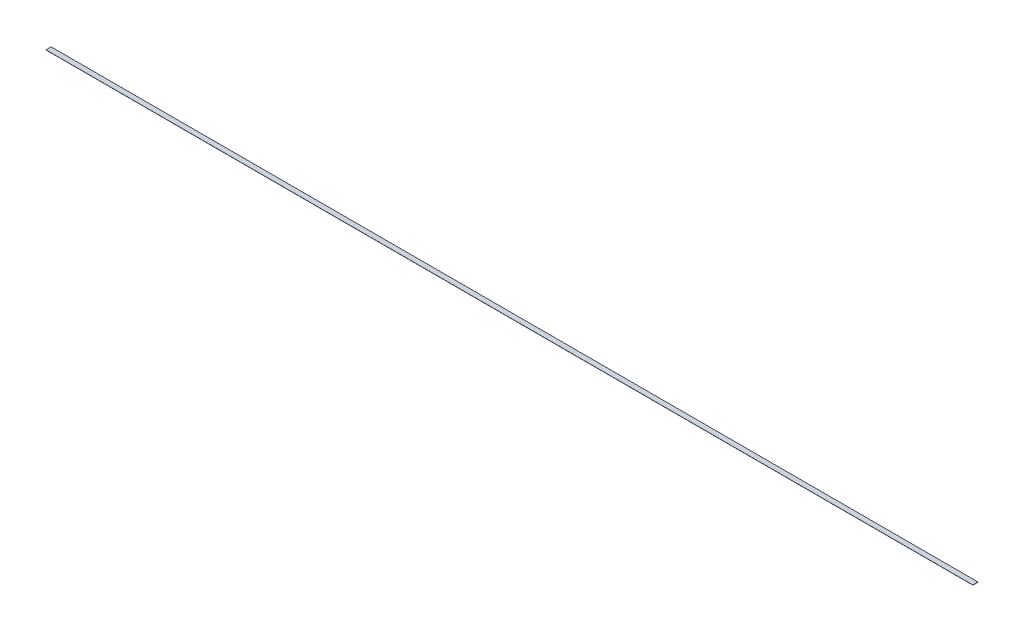
ISO-10303-21;
HEADER;
FILE_DESCRIPTION(('STEP AP214'),'2;1');
FILE_NAME('part.step','',(''),(''),'','','');
FILE_SCHEMA(('AUTOMOTIVE_DESIGN { 1 0 10303 214 1 1 1 1 }'));
ENDSEC;
DATA;
#1=APPLICATION_CONTEXT('core data for automotive mechanical design processes');
#2=APPLICATION_PROTOCOL_DEFINITION('international standard','automotive_design',2000,#1);
#3=PRODUCT_CONTEXT('',#1,'mechanical');
#4=PRODUCT('Part','Part','',(#3));
#5=PRODUCT_RELATED_PRODUCT_CATEGORY('part','',(#4));
#6=PRODUCT_DEFINITION_FORMATION('','',#4);
#7=PRODUCT_DEFINITION_CONTEXT('part definition',#1,'design');
#8=PRODUCT_DEFINITION('design','',#6,#7);
#9=PRODUCT_DEFINITION_SHAPE('','',#8);
#10=(LENGTH_UNIT() NAMED_UNIT(*) SI_UNIT(.MILLI.,.METRE.));
#11=(NAMED_UNIT(*) PLANE_ANGLE_UNIT() SI_UNIT($,.RADIAN.));
#12=(NAMED_UNIT(*) SI_UNIT($,.STERADIAN.) SOLID_ANGLE_UNIT());
#13=UNCERTAINTY_MEASURE_WITH_UNIT(LENGTH_MEASURE(1.E-05),#10,'distance_accuracy_value','');
#14=(GEOMETRIC_REPRESENTATION_CONTEXT(3) GLOBAL_UNCERTAINTY_ASSIGNED_CONTEXT((#13)) GLOBAL_UNIT_ASSIGNED_CONTEXT((#10,
#11,#12)) REPRESENTATION_CONTEXT('',''));
#15=CARTESIAN_POINT('',(0.,0.,0.));
#16=DIRECTION('',(0.,0.,1.));
#17=DIRECTION('',(1.,0.,0.));
#18=AXIS2_PLACEMENT_3D('',#15,#16,#17);
#19=CARTESIAN_POINT('',(0.,1.5875,0.));
#20=DIRECTION('',(1.,0.,0.));
#21=DIRECTION('',(0.,0.,-1.));
#22=AXIS2_PLACEMENT_3D('',#19,#20,#21);
#23=PLANE('',#22);
#24=DIRECTION('',(0.,0.,1.));
#25=VECTOR('',#24,1.);
#26=CARTESIAN_POINT('',(0.,0.,0.));
#27=LINE('',#26,#25);
#28=CARTESIAN_POINT('',(0.,0.,-50.8));
#29=VERTEX_POINT('',#28);
#30=CARTESIAN_POINT('',(0.,0.,0.));
#31=VERTEX_POINT('',#30);
#32=EDGE_CURVE('E98',#29,#31,#27,.T.);
#33=ORIENTED_EDGE('',*,*,#32,.T.);
#34=DIRECTION('',(0.,-1.,0.));
#35=VECTOR('',#34,1.);
#36=CARTESIAN_POINT('',(0.,1.5875,0.));
#37=LINE('',#36,#35);
#38=CARTESIAN_POINT('',(0.,1.5875,0.));
#39=VERTEX_POINT('',#38);
#40=EDGE_CURVE('E11',#39,#31,#37,.T.);
#41=ORIENTED_EDGE('',*,*,#40,.F.);
#42=DIRECTION('',(0.,0.,1.));
#43=VECTOR('',#42,1.);
#44=CARTESIAN_POINT('',(0.,1.5875,0.));
#45=LINE('',#44,#43);
#46=CARTESIAN_POINT('',(0.,1.5875,-50.8));
#47=VERTEX_POINT('',#46);
#48=EDGE_CURVE('E86',#47,#39,#45,.T.);
#49=ORIENTED_EDGE('',*,*,#48,.F.);
#50=DIRECTION('',(0.,-1.,0.));
#51=VECTOR('',#50,1.);
#52=CARTESIAN_POINT('',(0.,1.5875,-50.8));
#53=LINE('',#52,#51);
#54=EDGE_CURVE('E94',#47,#29,#53,.T.);
#55=ORIENTED_EDGE('',*,*,#54,.T.);
#56=EDGE_LOOP('',(#33,#41,#49,#55));
#57=FACE_BOUND('',#56,.T.);
#58=ADVANCED_FACE('F35',(#57),#23,.F.);
#59=CARTESIAN_POINT('',(0.,1.5875,0.));
#60=DIRECTION('',(0.,0.,-1.));
#61=DIRECTION('',(-1.,0.,0.));
#62=AXIS2_PLACEMENT_3D('',#59,#60,#61);
#63=PLANE('',#62);
#64=DIRECTION('',(1.,0.,0.));
#65=VECTOR('',#64,1.);
#66=CARTESIAN_POINT('',(0.,0.,0.));
#67=LINE('',#66,#65);
#68=CARTESIAN_POINT('',(9144.,0.,0.));
#69=VERTEX_POINT('',#68);
#70=EDGE_CURVE('E90',#31,#69,#67,.T.);
#71=ORIENTED_EDGE('',*,*,#70,.T.);
#72=DIRECTION('',(0.,-1.,0.));
#73=VECTOR('',#72,1.);
#74=CARTESIAN_POINT('',(9144.,1.5875,0.));
#75=LINE('',#74,#73);
#76=CARTESIAN_POINT('',(9144.,1.5875,0.));
#77=VERTEX_POINT('',#76);
#78=EDGE_CURVE('E43',#77,#69,#75,.T.);
#79=ORIENTED_EDGE('',*,*,#78,.F.);
#80=DIRECTION('',(1.,0.,0.));
#81=VECTOR('',#80,1.);
#82=CARTESIAN_POINT('',(0.,1.5875,0.));
#83=LINE('',#82,#81);
#84=EDGE_CURVE('E81',#39,#77,#83,.T.);
#85=ORIENTED_EDGE('',*,*,#84,.F.);
#86=ORIENTED_EDGE('',*,*,#40,.T.);
#87=EDGE_LOOP('',(#71,#79,#85,#86));
#88=FACE_BOUND('',#87,.T.);
#89=ADVANCED_FACE('F89',(#88),#63,.F.);
#90=CARTESIAN_POINT('',(9144.,1.5875,0.));
#91=DIRECTION('',(-1.,0.,0.));
#92=DIRECTION('',(0.,0.,1.));
#93=AXIS2_PLACEMENT_3D('',#90,#91,#92);
#94=PLANE('',#93);
#95=DIRECTION('',(0.,0.,-1.));
#96=VECTOR('',#95,1.);
#97=CARTESIAN_POINT('',(9144.,0.,0.));
#98=LINE('',#97,#96);
#99=CARTESIAN_POINT('',(9144.,0.,-50.8));
#100=VERTEX_POINT('',#99);
#101=EDGE_CURVE('E68',#69,#100,#98,.T.);
#102=ORIENTED_EDGE('',*,*,#101,.T.);
#103=DIRECTION('',(0.,-1.,0.));
#104=VECTOR('',#103,1.);
#105=CARTESIAN_POINT('',(9144.,1.5875,-50.8));
#106=LINE('',#105,#104);
#107=CARTESIAN_POINT('',(9144.,1.5875,-50.8));
#108=VERTEX_POINT('',#107);
#109=EDGE_CURVE('E91',#108,#100,#106,.T.);
#110=ORIENTED_EDGE('',*,*,#109,.F.);
#111=DIRECTION('',(0.,0.,-1.));
#112=VECTOR('',#111,1.);
#113=CARTESIAN_POINT('',(9144.,1.5875,0.));
#114=LINE('',#113,#112);
#115=EDGE_CURVE('E84',#77,#108,#114,.T.);
#116=ORIENTED_EDGE('',*,*,#115,.F.);
#117=ORIENTED_EDGE('',*,*,#78,.T.);
#118=EDGE_LOOP('',(#102,#110,#116,#117));
#119=FACE_BOUND('',#118,.T.);
#120=ADVANCED_FACE('F92',(#119),#94,.F.);
#121=CARTESIAN_POINT('',(0.,1.5875,-50.8));
#122=DIRECTION('',(0.,0.,1.));
#123=DIRECTION('',(1.,0.,0.));
#124=AXIS2_PLACEMENT_3D('',#121,#122,#123);
#125=PLANE('',#124);
#126=DIRECTION('',(-1.,0.,0.));
#127=VECTOR('',#126,1.);
#128=CARTESIAN_POINT('',(0.,0.,-50.8));
#129=LINE('',#128,#127);
#130=EDGE_CURVE('E74',#100,#29,#129,.T.);
#131=ORIENTED_EDGE('',*,*,#130,.T.);
#132=ORIENTED_EDGE('',*,*,#54,.F.);
#133=DIRECTION('',(-1.,0.,0.));
#134=VECTOR('',#133,1.);
#135=CARTESIAN_POINT('',(0.,1.5875,-50.8));
#136=LINE('',#135,#134);
#137=EDGE_CURVE('E51',#108,#47,#136,.T.);
#138=ORIENTED_EDGE('',*,*,#137,.F.);
#139=ORIENTED_EDGE('',*,*,#109,.T.);
#140=EDGE_LOOP('',(#131,#132,#138,#139));
#141=FACE_BOUND('',#140,.T.);
#142=ADVANCED_FACE('F105',(#141),#125,.F.);
#143=CARTESIAN_POINT('',(0.,1.5875,0.));
#144=DIRECTION('',(0.,-1.,0.));
#145=DIRECTION('',(0.,0.,-1.));
#146=AXIS2_PLACEMENT_3D('',#143,#144,#145);
#147=PLANE('',#146);
#148=ORIENTED_EDGE('',*,*,#48,.T.);
#149=ORIENTED_EDGE('',*,*,#84,.T.);
#150=ORIENTED_EDGE('',*,*,#115,.T.);
#151=ORIENTED_EDGE('',*,*,#137,.T.);
#152=EDGE_LOOP('',(#148,#149,#150,#151));
#153=FACE_BOUND('',#152,.T.);
#154=ADVANCED_FACE('F82',(#153),#147,.F.);
#155=CARTESIAN_POINT('',(0.,0.,0.));
#156=DIRECTION('',(0.,-1.,0.));
#157=DIRECTION('',(0.,0.,-1.));
#158=AXIS2_PLACEMENT_3D('',#155,#156,#157);
#159=PLANE('',#158);
#160=ORIENTED_EDGE('',*,*,#32,.F.);
#161=ORIENTED_EDGE('',*,*,#130,.F.);
#162=ORIENTED_EDGE('',*,*,#101,.F.);
#163=ORIENTED_EDGE('',*,*,#70,.F.);
#164=EDGE_LOOP('',(#160,#161,#162,#163));
#165=FACE_BOUND('',#164,.T.);
#166=ADVANCED_FACE('F108',(#165),#159,.T.);
#167=CLOSED_SHELL('',(#58,#89,#120,#142,#154,#166));
#168=MANIFOLD_SOLID_BREP('B2',#167);
#169=ADVANCED_BREP_SHAPE_REPRESENTATION('',(#18,#168),#14);
#170=SHAPE_DEFINITION_REPRESENTATION(#9,#169);
ENDSEC;
END-ISO-10303-21;
